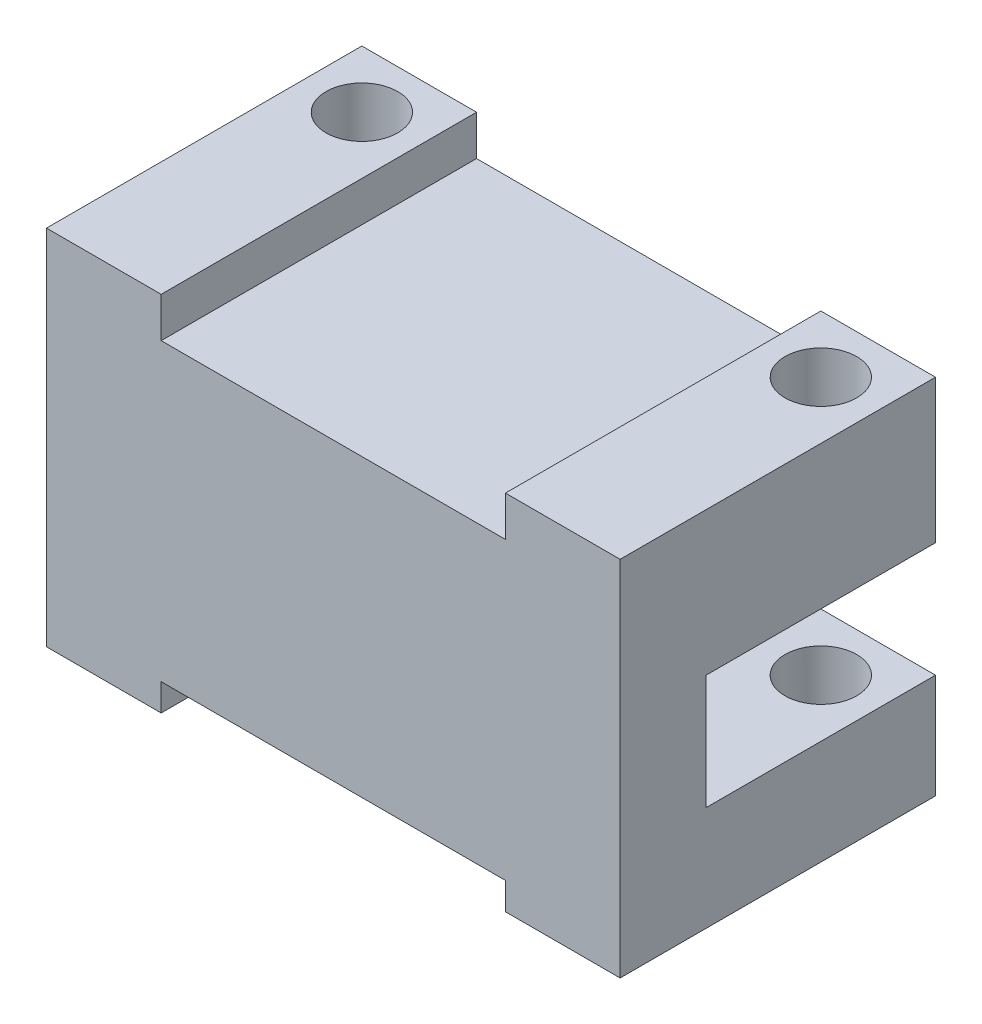
ISO-10303-21;
HEADER;
FILE_DESCRIPTION(('STEP AP214'),'2;1');
FILE_NAME('part.step','',(''),(''),'','','');
FILE_SCHEMA(('AUTOMOTIVE_DESIGN { 1 0 10303 214 1 1 1 1 }'));
ENDSEC;
DATA;
#1=APPLICATION_CONTEXT('core data for automotive mechanical design processes');
#2=APPLICATION_PROTOCOL_DEFINITION('international standard','automotive_design',2000,#1);
#3=PRODUCT_CONTEXT('',#1,'mechanical');
#4=PRODUCT('Part','Part','',(#3));
#5=PRODUCT_RELATED_PRODUCT_CATEGORY('part','',(#4));
#6=PRODUCT_DEFINITION_FORMATION('','',#4);
#7=PRODUCT_DEFINITION_CONTEXT('part definition',#1,'design');
#8=PRODUCT_DEFINITION('design','',#6,#7);
#9=PRODUCT_DEFINITION_SHAPE('','',#8);
#10=(LENGTH_UNIT() NAMED_UNIT(*) SI_UNIT(.MILLI.,.METRE.));
#11=(NAMED_UNIT(*) PLANE_ANGLE_UNIT() SI_UNIT($,.RADIAN.));
#12=(NAMED_UNIT(*) SI_UNIT($,.STERADIAN.) SOLID_ANGLE_UNIT());
#13=UNCERTAINTY_MEASURE_WITH_UNIT(LENGTH_MEASURE(1.E-05),#10,'distance_accuracy_value','');
#14=(GEOMETRIC_REPRESENTATION_CONTEXT(3) GLOBAL_UNCERTAINTY_ASSIGNED_CONTEXT((#13)) GLOBAL_UNIT_ASSIGNED_CONTEXT((#10,
#11,#12)) REPRESENTATION_CONTEXT('',''));
#15=CARTESIAN_POINT('',(0.,0.,0.));
#16=DIRECTION('',(0.,0.,1.));
#17=DIRECTION('',(1.,0.,0.));
#18=AXIS2_PLACEMENT_3D('',#15,#16,#17);
#19=CARTESIAN_POINT('',(20.6185390455604,-73.2027077643161,3.));
#20=DIRECTION('',(0.,-1.,0.));
#21=DIRECTION('',(1.,0.,0.));
#22=AXIS2_PLACEMENT_3D('',#19,#20,#21);
#23=PLANE('',#22);
#24=CARTESIAN_POINT('',(22.6185390455604,-73.2027077643161,-6.));
#25=DIRECTION('',(0.,1.,0.));
#26=DIRECTION('',(0.,0.,1.));
#27=AXIS2_PLACEMENT_3D('',#24,#25,#26);
#28=CIRCLE('',#27,1.25);
#29=CARTESIAN_POINT('',(22.6185390455604,-73.2027077643161,-4.75));
#30=VERTEX_POINT('',#29);
#31=EDGE_CURVE('E423',#30,#30,#28,.T.);
#32=ORIENTED_EDGE('',*,*,#31,.F.);
#33=EDGE_LOOP('',(#32));
#34=FACE_BOUND('',#33,.T.);
#35=DIRECTION('',(-1.,0.,0.));
#36=VECTOR('',#35,1.);
#37=CARTESIAN_POINT('',(20.6185390455604,-73.2027077643161,3.));
#38=LINE('',#37,#36);
#39=CARTESIAN_POINT('',(24.6185390455604,-73.2027077643161,3.));
#40=VERTEX_POINT('',#39);
#41=CARTESIAN_POINT('',(20.6185390455604,-73.2027077643161,3.));
#42=VERTEX_POINT('',#41);
#43=EDGE_CURVE('E338',#40,#42,#38,.T.);
#44=ORIENTED_EDGE('',*,*,#43,.F.);
#45=DIRECTION('',(0.,0.,1.));
#46=VECTOR('',#45,1.);
#47=CARTESIAN_POINT('',(24.6185390455604,-73.2027077643161,-24.7));
#48=LINE('',#47,#46);
#49=CARTESIAN_POINT('',(24.6185390455604,-73.2027077643161,-8.00000000000001));
#50=VERTEX_POINT('',#49);
#51=EDGE_CURVE('E163',#50,#40,#48,.T.);
#52=ORIENTED_EDGE('',*,*,#51,.F.);
#53=DIRECTION('',(1.,0.,0.));
#54=VECTOR('',#53,1.);
#55=CARTESIAN_POINT('',(40.6261390455604,-73.2027077643161,-8.));
#56=LINE('',#55,#54);
#57=CARTESIAN_POINT('',(20.6185390455604,-73.2027077643161,-8.));
#58=VERTEX_POINT('',#57);
#59=EDGE_CURVE('E217',#58,#50,#56,.T.);
#60=ORIENTED_EDGE('',*,*,#59,.F.);
#61=DIRECTION('',(0.,0.,-1.));
#62=VECTOR('',#61,1.);
#63=CARTESIAN_POINT('',(20.6185390455604,-73.2027077643161,3.));
#64=LINE('',#63,#62);
#65=EDGE_CURVE('E260',#42,#58,#64,.T.);
#66=ORIENTED_EDGE('',*,*,#65,.F.);
#67=EDGE_LOOP('',(#44,#52,#60,#66));
#68=FACE_BOUND('',#67,.T.);
#69=ADVANCED_FACE('F33',(#34,#68),#23,.F.);
#70=CARTESIAN_POINT('',(0.,0.,0.));
#71=DIRECTION('',(0.,0.,1.));
#72=DIRECTION('',(1.,0.,0.));
#73=AXIS2_PLACEMENT_3D('',#70,#71,#72);
#74=PLANE('',#73);
#75=DIRECTION('',(1.,0.,0.));
#76=VECTOR('',#75,1.);
#77=CARTESIAN_POINT('',(40.6261390455604,-82.2027077511568,0.));
#78=LINE('',#77,#76);
#79=CARTESIAN_POINT('',(20.6185390455604,-82.2027077511568,0.));
#80=VERTEX_POINT('',#79);
#81=CARTESIAN_POINT('',(40.6261390455604,-82.2027077511568,0.));
#82=VERTEX_POINT('',#81);
#83=EDGE_CURVE('E175',#80,#82,#78,.T.);
#84=ORIENTED_EDGE('',*,*,#83,.F.);
#85=DIRECTION('',(0.,-1.,0.));
#86=VECTOR('',#85,1.);
#87=CARTESIAN_POINT('',(20.6185390455604,-73.2027077643161,0.));
#88=LINE('',#87,#86);
#89=CARTESIAN_POINT('',(20.6185390455604,-78.2027077511569,0.));
#90=VERTEX_POINT('',#89);
#91=EDGE_CURVE('E229',#90,#80,#88,.T.);
#92=ORIENTED_EDGE('',*,*,#91,.F.);
#93=DIRECTION('',(-1.,0.,0.));
#94=VECTOR('',#93,1.);
#95=CARTESIAN_POINT('',(40.6261390455604,-78.2027077511569,0.));
#96=LINE('',#95,#94);
#97=CARTESIAN_POINT('',(40.6261390455604,-78.2027077511569,0.));
#98=VERTEX_POINT('',#97);
#99=EDGE_CURVE('E207',#98,#90,#96,.T.);
#100=ORIENTED_EDGE('',*,*,#99,.F.);
#101=DIRECTION('',(0.,1.,0.));
#102=VECTOR('',#101,1.);
#103=CARTESIAN_POINT('',(40.6261390455604,-85.8498182715212,0.));
#104=LINE('',#103,#102);
#105=EDGE_CURVE('E58',#82,#98,#104,.T.);
#106=ORIENTED_EDGE('',*,*,#105,.F.);
#107=EDGE_LOOP('',(#84,#92,#100,#106));
#108=FACE_BOUND('',#107,.T.);
#109=ADVANCED_FACE('F307',(#108),#74,.F.);
#110=CARTESIAN_POINT('',(36.6261390455604,-85.8498182715212,3.));
#111=DIRECTION('',(0.,1.,0.));
#112=DIRECTION('',(0.,0.,1.));
#113=AXIS2_PLACEMENT_3D('',#110,#111,#112);
#114=PLANE('',#113);
#115=CARTESIAN_POINT('',(38.6261390455604,-85.8498182715212,-6.00000000000001));
#116=DIRECTION('',(0.,1.,0.));
#117=DIRECTION('',(0.,0.,1.));
#118=AXIS2_PLACEMENT_3D('',#115,#116,#117);
#119=CIRCLE('',#118,1.25);
#120=CARTESIAN_POINT('',(38.6261390455604,-85.8498182715212,-4.75000000000001));
#121=VERTEX_POINT('',#120);
#122=EDGE_CURVE('E166',#121,#121,#119,.T.);
#123=ORIENTED_EDGE('',*,*,#122,.T.);
#124=EDGE_LOOP('',(#123));
#125=FACE_BOUND('',#124,.T.);
#126=DIRECTION('',(0.,0.,-1.));
#127=VECTOR('',#126,1.);
#128=CARTESIAN_POINT('',(36.6261390455604,-85.8498182715212,3.));
#129=LINE('',#128,#127);
#130=CARTESIAN_POINT('',(36.6261390455604,-85.8498182715212,3.));
#131=VERTEX_POINT('',#130);
#132=CARTESIAN_POINT('',(36.6261390455604,-85.8498182715212,-8.));
#133=VERTEX_POINT('',#132);
#134=EDGE_CURVE('E250',#131,#133,#129,.T.);
#135=ORIENTED_EDGE('',*,*,#134,.T.);
#136=DIRECTION('',(-1.,0.,0.));
#137=VECTOR('',#136,1.);
#138=CARTESIAN_POINT('',(40.6261390455604,-85.8498182715212,-8.));
#139=LINE('',#138,#137);
#140=CARTESIAN_POINT('',(40.6261390455604,-85.8498182715212,-8.));
#141=VERTEX_POINT('',#140);
#142=EDGE_CURVE('E180',#141,#133,#139,.T.);
#143=ORIENTED_EDGE('',*,*,#142,.F.);
#144=DIRECTION('',(0.,0.,-1.));
#145=VECTOR('',#144,1.);
#146=CARTESIAN_POINT('',(40.6261390455604,-85.8498182715212,3.));
#147=LINE('',#146,#145);
#148=CARTESIAN_POINT('',(40.6261390455604,-85.8498182715212,3.));
#149=VERTEX_POINT('',#148);
#150=EDGE_CURVE('E264',#149,#141,#147,.T.);
#151=ORIENTED_EDGE('',*,*,#150,.F.);
#152=DIRECTION('',(1.,0.,0.));
#153=VECTOR('',#152,1.);
#154=CARTESIAN_POINT('',(36.6261390455604,-85.8498182715212,3.));
#155=LINE('',#154,#153);
#156=EDGE_CURVE('E223',#131,#149,#155,.T.);
#157=ORIENTED_EDGE('',*,*,#156,.F.);
#158=EDGE_LOOP('',(#135,#143,#151,#157));
#159=FACE_BOUND('',#158,.T.);
#160=ADVANCED_FACE('F35',(#125,#159),#114,.F.);
#161=CARTESIAN_POINT('',(40.6261390455604,-85.8498182715212,3.));
#162=DIRECTION('',(-1.,0.,0.));
#163=DIRECTION('',(0.,0.,1.));
#164=AXIS2_PLACEMENT_3D('',#161,#162,#163);
#165=PLANE('',#164);
#166=ORIENTED_EDGE('',*,*,#150,.T.);
#167=DIRECTION('',(0.,-1.,0.));
#168=VECTOR('',#167,1.);
#169=CARTESIAN_POINT('',(40.6261390455604,-82.2027077511568,-8.));
#170=LINE('',#169,#168);
#171=CARTESIAN_POINT('',(40.6261390455604,-82.2027077511568,-8.));
#172=VERTEX_POINT('',#171);
#173=EDGE_CURVE('E199',#172,#141,#170,.T.);
#174=ORIENTED_EDGE('',*,*,#173,.F.);
#175=DIRECTION('',(0.,0.,1.));
#176=VECTOR('',#175,1.);
#177=CARTESIAN_POINT('',(40.6261390455604,-82.2027077511568,-8.));
#178=LINE('',#177,#176);
#179=EDGE_CURVE('E202',#172,#82,#178,.T.);
#180=ORIENTED_EDGE('',*,*,#179,.T.);
#181=ORIENTED_EDGE('',*,*,#105,.T.);
#182=DIRECTION('',(0.,0.,1.));
#183=VECTOR('',#182,1.);
#184=CARTESIAN_POINT('',(40.6261390455604,-78.2027077511569,-8.));
#185=LINE('',#184,#183);
#186=CARTESIAN_POINT('',(40.6261390455604,-78.2027077511569,-8.));
#187=VERTEX_POINT('',#186);
#188=EDGE_CURVE('E234',#187,#98,#185,.T.);
#189=ORIENTED_EDGE('',*,*,#188,.F.);
#190=DIRECTION('',(0.,-1.,0.));
#191=VECTOR('',#190,1.);
#192=CARTESIAN_POINT('',(40.6261390455604,-73.2027077643161,-8.));
#193=LINE('',#192,#191);
#194=CARTESIAN_POINT('',(40.6261390455604,-73.2027077643161,-8.));
#195=VERTEX_POINT('',#194);
#196=EDGE_CURVE('E208',#195,#187,#193,.T.);
#197=ORIENTED_EDGE('',*,*,#196,.F.);
#198=DIRECTION('',(0.,0.,-1.));
#199=VECTOR('',#198,1.);
#200=CARTESIAN_POINT('',(40.6261390455604,-73.2027077643161,3.));
#201=LINE('',#200,#199);
#202=CARTESIAN_POINT('',(40.6261390455604,-73.2027077643161,3.));
#203=VERTEX_POINT('',#202);
#204=EDGE_CURVE('E262',#203,#195,#201,.T.);
#205=ORIENTED_EDGE('',*,*,#204,.F.);
#206=DIRECTION('',(0.,1.,0.));
#207=VECTOR('',#206,1.);
#208=CARTESIAN_POINT('',(40.6261390455604,-85.8498182715212,3.));
#209=LINE('',#208,#207);
#210=EDGE_CURVE('E341',#149,#203,#209,.T.);
#211=ORIENTED_EDGE('',*,*,#210,.F.);
#212=EDGE_LOOP('',(#166,#174,#180,#181,#189,#197,#205,#211));
#213=FACE_BOUND('',#212,.T.);
#214=ADVANCED_FACE('F321',(#213),#165,.F.);
#215=CARTESIAN_POINT('',(38.6261390455604,-73.2027077643161,-6.00000000000001));
#216=DIRECTION('',(0.,1.,0.));
#217=DIRECTION('',(0.,0.,1.));
#218=AXIS2_PLACEMENT_3D('',#215,#216,#217);
#219=CIRCLE('',#218,1.25);
#220=CARTESIAN_POINT('',(38.6261390455604,-73.2027077643161,-4.75000000000001));
#221=VERTEX_POINT('',#220);
#222=EDGE_CURVE('E272',#221,#221,#219,.T.);
#223=ORIENTED_EDGE('',*,*,#222,.F.);
#224=EDGE_LOOP('',(#223));
#225=FACE_BOUND('',#224,.T.);
#226=CARTESIAN_POINT('',(36.6261390455604,-73.2027077643161,-8.00000000000001));
#227=VERTEX_POINT('',#226);
#228=EDGE_CURVE('E216',#227,#195,#56,.T.);
#229=ORIENTED_EDGE('',*,*,#228,.F.);
#230=DIRECTION('',(0.,0.,1.));
#231=VECTOR('',#230,1.);
#232=CARTESIAN_POINT('',(36.6261390455604,-73.2027077643161,-24.7));
#233=LINE('',#232,#231);
#234=CARTESIAN_POINT('',(36.6261390455604,-73.2027077643161,3.));
#235=VERTEX_POINT('',#234);
#236=EDGE_CURVE('E176',#227,#235,#233,.T.);
#237=ORIENTED_EDGE('',*,*,#236,.T.);
#238=EDGE_CURVE('E340',#203,#235,#38,.T.);
#239=ORIENTED_EDGE('',*,*,#238,.F.);
#240=ORIENTED_EDGE('',*,*,#204,.T.);
#241=EDGE_LOOP('',(#229,#237,#239,#240));
#242=FACE_BOUND('',#241,.T.);
#243=ADVANCED_FACE('F310',(#225,#242),#23,.F.);
#244=CARTESIAN_POINT('',(20.6185390455604,-73.2027077643161,3.));
#245=DIRECTION('',(1.,0.,0.));
#246=DIRECTION('',(0.,1.,0.));
#247=AXIS2_PLACEMENT_3D('',#244,#245,#246);
#248=PLANE('',#247);
#249=ORIENTED_EDGE('',*,*,#65,.T.);
#250=DIRECTION('',(0.,1.,0.));
#251=VECTOR('',#250,1.);
#252=CARTESIAN_POINT('',(20.6185390455604,-73.2027077643161,-8.));
#253=LINE('',#252,#251);
#254=CARTESIAN_POINT('',(20.6185390455604,-78.2027077511569,-8.));
#255=VERTEX_POINT('',#254);
#256=EDGE_CURVE('E213',#255,#58,#253,.T.);
#257=ORIENTED_EDGE('',*,*,#256,.F.);
#258=DIRECTION('',(0.,0.,1.));
#259=VECTOR('',#258,1.);
#260=CARTESIAN_POINT('',(20.6185390455604,-78.2027077511569,-8.));
#261=LINE('',#260,#259);
#262=EDGE_CURVE('E220',#255,#90,#261,.T.);
#263=ORIENTED_EDGE('',*,*,#262,.T.);
#264=ORIENTED_EDGE('',*,*,#91,.T.);
#265=DIRECTION('',(0.,0.,1.));
#266=VECTOR('',#265,1.);
#267=CARTESIAN_POINT('',(20.6185390455604,-82.2027077511568,-8.));
#268=LINE('',#267,#266);
#269=CARTESIAN_POINT('',(20.6185390455604,-82.2027077511568,-8.));
#270=VERTEX_POINT('',#269);
#271=EDGE_CURVE('E205',#270,#80,#268,.T.);
#272=ORIENTED_EDGE('',*,*,#271,.F.);
#273=DIRECTION('',(0.,1.,0.));
#274=VECTOR('',#273,1.);
#275=CARTESIAN_POINT('',(20.6185390455604,-85.8498182715212,-8.));
#276=LINE('',#275,#274);
#277=CARTESIAN_POINT('',(20.6185390455604,-85.8498182715212,-8.));
#278=VERTEX_POINT('',#277);
#279=EDGE_CURVE('E195',#278,#270,#276,.T.);
#280=ORIENTED_EDGE('',*,*,#279,.F.);
#281=DIRECTION('',(0.,0.,-1.));
#282=VECTOR('',#281,1.);
#283=CARTESIAN_POINT('',(20.6185390455604,-85.8498182715212,3.));
#284=LINE('',#283,#282);
#285=CARTESIAN_POINT('',(20.6185390455604,-85.8498182715212,3.));
#286=VERTEX_POINT('',#285);
#287=EDGE_CURVE('E258',#286,#278,#284,.T.);
#288=ORIENTED_EDGE('',*,*,#287,.F.);
#289=DIRECTION('',(0.,-1.,0.));
#290=VECTOR('',#289,1.);
#291=CARTESIAN_POINT('',(20.6185390455604,-73.2027077643161,3.));
#292=LINE('',#291,#290);
#293=EDGE_CURVE('E343',#42,#286,#292,.T.);
#294=ORIENTED_EDGE('',*,*,#293,.F.);
#295=EDGE_LOOP('',(#249,#257,#263,#264,#272,#280,#288,#294));
#296=FACE_BOUND('',#295,.T.);
#297=ADVANCED_FACE('F320',(#296),#248,.F.);
#298=CARTESIAN_POINT('',(20.6185390455604,-85.8498182715212,3.));
#299=DIRECTION('',(0.,1.,0.));
#300=DIRECTION('',(0.,0.,1.));
#301=AXIS2_PLACEMENT_3D('',#298,#299,#300);
#302=PLANE('',#301);
#303=CARTESIAN_POINT('',(22.6185390455604,-85.8498182715212,-6.));
#304=DIRECTION('',(0.,1.,0.));
#305=DIRECTION('',(0.,0.,1.));
#306=AXIS2_PLACEMENT_3D('',#303,#304,#305);
#307=CIRCLE('',#306,1.25);
#308=CARTESIAN_POINT('',(22.6185390455604,-85.8498182715212,-4.75));
#309=VERTEX_POINT('',#308);
#310=EDGE_CURVE('E278',#309,#309,#307,.T.);
#311=ORIENTED_EDGE('',*,*,#310,.T.);
#312=EDGE_LOOP('',(#311));
#313=FACE_BOUND('',#312,.T.);
#314=ORIENTED_EDGE('',*,*,#287,.T.);
#315=DIRECTION('',(-1.,0.,0.));
#316=VECTOR('',#315,1.);
#317=CARTESIAN_POINT('',(24.6185390455604,-85.8498182715212,-8.));
#318=LINE('',#317,#316);
#319=CARTESIAN_POINT('',(24.6185390455604,-85.8498182715212,-8.));
#320=VERTEX_POINT('',#319);
#321=EDGE_CURVE('E192',#320,#278,#318,.T.);
#322=ORIENTED_EDGE('',*,*,#321,.F.);
#323=DIRECTION('',(0.,0.,-1.));
#324=VECTOR('',#323,1.);
#325=CARTESIAN_POINT('',(24.6185390455604,-85.8498182715212,3.));
#326=LINE('',#325,#324);
#327=CARTESIAN_POINT('',(24.6185390455604,-85.8498182715212,3.));
#328=VERTEX_POINT('',#327);
#329=EDGE_CURVE('E256',#328,#320,#326,.T.);
#330=ORIENTED_EDGE('',*,*,#329,.F.);
#331=DIRECTION('',(1.,0.,0.));
#332=VECTOR('',#331,1.);
#333=CARTESIAN_POINT('',(20.6185390455604,-85.8498182715212,3.));
#334=LINE('',#333,#332);
#335=EDGE_CURVE('E346',#286,#328,#334,.T.);
#336=ORIENTED_EDGE('',*,*,#335,.F.);
#337=EDGE_LOOP('',(#314,#322,#330,#336));
#338=FACE_BOUND('',#337,.T.);
#339=ADVANCED_FACE('F327',(#313,#338),#302,.F.);
#340=CARTESIAN_POINT('',(24.6185390455604,-84.9027077644928,3.));
#341=DIRECTION('',(-1.,0.,0.));
#342=DIRECTION('',(0.,-1.,0.));
#343=AXIS2_PLACEMENT_3D('',#340,#341,#342);
#344=PLANE('',#343);
#345=ORIENTED_EDGE('',*,*,#329,.T.);
#346=DIRECTION('',(0.,-1.,0.));
#347=VECTOR('',#346,1.);
#348=CARTESIAN_POINT('',(24.6185390455604,-84.9027077644928,-8.));
#349=LINE('',#348,#347);
#350=CARTESIAN_POINT('',(24.6185390455604,-84.9027077644928,-8.));
#351=VERTEX_POINT('',#350);
#352=EDGE_CURVE('E189',#351,#320,#349,.T.);
#353=ORIENTED_EDGE('',*,*,#352,.F.);
#354=DIRECTION('',(0.,0.,-1.));
#355=VECTOR('',#354,1.);
#356=CARTESIAN_POINT('',(24.6185390455604,-84.9027077644928,3.));
#357=LINE('',#356,#355);
#358=CARTESIAN_POINT('',(24.6185390455604,-84.9027077644928,3.));
#359=VERTEX_POINT('',#358);
#360=EDGE_CURVE('E254',#359,#351,#357,.T.);
#361=ORIENTED_EDGE('',*,*,#360,.F.);
#362=DIRECTION('',(0.,1.,0.));
#363=VECTOR('',#362,1.);
#364=CARTESIAN_POINT('',(24.6185390455604,-84.9027077644928,3.));
#365=LINE('',#364,#363);
#366=EDGE_CURVE('E348',#328,#359,#365,.T.);
#367=ORIENTED_EDGE('',*,*,#366,.F.);
#368=EDGE_LOOP('',(#345,#353,#361,#367));
#369=FACE_BOUND('',#368,.T.);
#370=ADVANCED_FACE('F378',(#369),#344,.F.);
#371=CARTESIAN_POINT('',(36.6261390455604,-84.9027077644928,3.));
#372=DIRECTION('',(0.,1.,0.));
#373=DIRECTION('',(0.,0.,1.));
#374=AXIS2_PLACEMENT_3D('',#371,#372,#373);
#375=PLANE('',#374);
#376=ORIENTED_EDGE('',*,*,#360,.T.);
#377=DIRECTION('',(-1.,0.,0.));
#378=VECTOR('',#377,1.);
#379=CARTESIAN_POINT('',(36.6261390455604,-84.9027077644928,-8.));
#380=LINE('',#379,#378);
#381=CARTESIAN_POINT('',(36.6261390455604,-84.9027077644928,-8.));
#382=VERTEX_POINT('',#381);
#383=EDGE_CURVE('E186',#382,#351,#380,.T.);
#384=ORIENTED_EDGE('',*,*,#383,.F.);
#385=DIRECTION('',(0.,0.,-1.));
#386=VECTOR('',#385,1.);
#387=CARTESIAN_POINT('',(36.6261390455604,-84.9027077644928,3.));
#388=LINE('',#387,#386);
#389=CARTESIAN_POINT('',(36.6261390455604,-84.9027077644928,3.));
#390=VERTEX_POINT('',#389);
#391=EDGE_CURVE('E252',#390,#382,#388,.T.);
#392=ORIENTED_EDGE('',*,*,#391,.F.);
#393=DIRECTION('',(1.,0.,0.));
#394=VECTOR('',#393,1.);
#395=CARTESIAN_POINT('',(36.6261390455604,-84.9027077644928,3.));
#396=LINE('',#395,#394);
#397=EDGE_CURVE('E349',#359,#390,#396,.T.);
#398=ORIENTED_EDGE('',*,*,#397,.F.);
#399=EDGE_LOOP('',(#376,#384,#392,#398));
#400=FACE_BOUND('',#399,.T.);
#401=ADVANCED_FACE('F381',(#400),#375,.F.);
#402=CARTESIAN_POINT('',(36.6261390455604,-85.8498182715212,3.));
#403=DIRECTION('',(1.,0.,0.));
#404=DIRECTION('',(0.,0.,-1.));
#405=AXIS2_PLACEMENT_3D('',#402,#403,#404);
#406=PLANE('',#405);
#407=ORIENTED_EDGE('',*,*,#391,.T.);
#408=DIRECTION('',(0.,1.,0.));
#409=VECTOR('',#408,1.);
#410=CARTESIAN_POINT('',(36.6261390455604,-85.8498182715212,-8.));
#411=LINE('',#410,#409);
#412=EDGE_CURVE('E183',#133,#382,#411,.T.);
#413=ORIENTED_EDGE('',*,*,#412,.F.);
#414=ORIENTED_EDGE('',*,*,#134,.F.);
#415=DIRECTION('',(0.,-1.,0.));
#416=VECTOR('',#415,1.);
#417=CARTESIAN_POINT('',(36.6261390455604,-85.8498182715212,3.));
#418=LINE('',#417,#416);
#419=EDGE_CURVE('E246',#390,#131,#418,.T.);
#420=ORIENTED_EDGE('',*,*,#419,.F.);
#421=EDGE_LOOP('',(#407,#413,#414,#420));
#422=FACE_BOUND('',#421,.T.);
#423=ADVANCED_FACE('F358',(#422),#406,.F.);
#424=CARTESIAN_POINT('',(0.,0.,3.));
#425=DIRECTION('',(0.,0.,1.));
#426=DIRECTION('',(1.,0.,0.));
#427=AXIS2_PLACEMENT_3D('',#424,#425,#426);
#428=PLANE('',#427);
#429=DIRECTION('',(0.,-1.,0.));
#430=VECTOR('',#429,1.);
#431=CARTESIAN_POINT('',(24.6185390455604,-73.2027077643161,3.));
#432=LINE('',#431,#430);
#433=CARTESIAN_POINT('',(24.6185390455604,-74.6027077643161,3.));
#434=VERTEX_POINT('',#433);
#435=EDGE_CURVE('E160',#40,#434,#432,.T.);
#436=ORIENTED_EDGE('',*,*,#435,.F.);
#437=ORIENTED_EDGE('',*,*,#43,.T.);
#438=ORIENTED_EDGE('',*,*,#293,.T.);
#439=ORIENTED_EDGE('',*,*,#335,.T.);
#440=ORIENTED_EDGE('',*,*,#366,.T.);
#441=ORIENTED_EDGE('',*,*,#397,.T.);
#442=ORIENTED_EDGE('',*,*,#419,.T.);
#443=ORIENTED_EDGE('',*,*,#156,.T.);
#444=ORIENTED_EDGE('',*,*,#210,.T.);
#445=ORIENTED_EDGE('',*,*,#238,.T.);
#446=DIRECTION('',(0.,1.,0.));
#447=VECTOR('',#446,1.);
#448=CARTESIAN_POINT('',(36.6261390455604,-73.2027077643161,3.));
#449=LINE('',#448,#447);
#450=CARTESIAN_POINT('',(36.6261390455604,-74.6027077643161,3.));
#451=VERTEX_POINT('',#450);
#452=EDGE_CURVE('E157',#451,#235,#449,.T.);
#453=ORIENTED_EDGE('',*,*,#452,.F.);
#454=DIRECTION('',(1.,0.,0.));
#455=VECTOR('',#454,1.);
#456=CARTESIAN_POINT('',(24.6185390455604,-74.6027077643161,3.));
#457=LINE('',#456,#455);
#458=EDGE_CURVE('E151',#434,#451,#457,.T.);
#459=ORIENTED_EDGE('',*,*,#458,.F.);
#460=EDGE_LOOP('',(#436,#437,#438,#439,#440,#441,#442,#443,#444,#445,#453,#459));
#461=FACE_BOUND('',#460,.T.);
#462=ADVANCED_FACE('F168',(#461),#428,.T.);
#463=CARTESIAN_POINT('',(40.6261390455604,-78.2027077511569,-8.));
#464=DIRECTION('',(0.,1.,0.));
#465=DIRECTION('',(0.,0.,1.));
#466=AXIS2_PLACEMENT_3D('',#463,#464,#465);
#467=PLANE('',#466);
#468=CARTESIAN_POINT('',(22.6185390455604,-78.2027077511569,-6.));
#469=DIRECTION('',(0.,1.,0.));
#470=DIRECTION('',(0.,0.,1.));
#471=AXIS2_PLACEMENT_3D('',#468,#469,#470);
#472=CIRCLE('',#471,1.25);
#473=CARTESIAN_POINT('',(22.6185390455604,-78.2027077511569,-4.75));
#474=VERTEX_POINT('',#473);
#475=EDGE_CURVE('E37',#474,#474,#472,.T.);
#476=ORIENTED_EDGE('',*,*,#475,.T.);
#477=EDGE_LOOP('',(#476));
#478=FACE_BOUND('',#477,.T.);
#479=CARTESIAN_POINT('',(38.6261390455604,-78.2027077511569,-6.00000000000001));
#480=DIRECTION('',(0.,1.,0.));
#481=DIRECTION('',(0.,0.,1.));
#482=AXIS2_PLACEMENT_3D('',#479,#480,#481);
#483=CIRCLE('',#482,1.25);
#484=CARTESIAN_POINT('',(38.6261390455604,-78.2027077511569,-4.75000000000001));
#485=VERTEX_POINT('',#484);
#486=EDGE_CURVE('E269',#485,#485,#483,.T.);
#487=ORIENTED_EDGE('',*,*,#486,.T.);
#488=EDGE_LOOP('',(#487));
#489=FACE_BOUND('',#488,.T.);
#490=ORIENTED_EDGE('',*,*,#99,.T.);
#491=ORIENTED_EDGE('',*,*,#262,.F.);
#492=DIRECTION('',(-1.,0.,0.));
#493=VECTOR('',#492,1.);
#494=CARTESIAN_POINT('',(40.6261390455604,-78.2027077511569,-8.));
#495=LINE('',#494,#493);
#496=EDGE_CURVE('E211',#187,#255,#495,.T.);
#497=ORIENTED_EDGE('',*,*,#496,.F.);
#498=ORIENTED_EDGE('',*,*,#188,.T.);
#499=EDGE_LOOP('',(#490,#491,#497,#498));
#500=FACE_BOUND('',#499,.T.);
#501=ADVANCED_FACE('F368',(#478,#489,#500),#467,.F.);
#502=CARTESIAN_POINT('',(0.,0.,-8.));
#503=DIRECTION('',(0.,0.,-1.));
#504=DIRECTION('',(-1.,0.,0.));
#505=AXIS2_PLACEMENT_3D('',#502,#503,#504);
#506=PLANE('',#505);
#507=DIRECTION('',(0.,1.,0.));
#508=VECTOR('',#507,1.);
#509=CARTESIAN_POINT('',(24.6185390455604,0.,-8.));
#510=LINE('',#509,#508);
#511=CARTESIAN_POINT('',(24.6185390455604,-74.6027077643161,-8.00000000000001));
#512=VERTEX_POINT('',#511);
#513=EDGE_CURVE('E11',#512,#50,#510,.T.);
#514=ORIENTED_EDGE('',*,*,#513,.F.);
#515=DIRECTION('',(-1.,0.,0.));
#516=VECTOR('',#515,1.);
#517=CARTESIAN_POINT('',(0.,-74.6027077643161,-8.));
#518=LINE('',#517,#516);
#519=CARTESIAN_POINT('',(36.6261390455604,-74.6027077643161,-8.));
#520=VERTEX_POINT('',#519);
#521=EDGE_CURVE('E154',#520,#512,#518,.T.);
#522=ORIENTED_EDGE('',*,*,#521,.F.);
#523=DIRECTION('',(0.,-1.,0.));
#524=VECTOR('',#523,1.);
#525=CARTESIAN_POINT('',(36.6261390455604,0.,-8.));
#526=LINE('',#525,#524);
#527=EDGE_CURVE('E42',#227,#520,#526,.T.);
#528=ORIENTED_EDGE('',*,*,#527,.F.);
#529=ORIENTED_EDGE('',*,*,#228,.T.);
#530=ORIENTED_EDGE('',*,*,#196,.T.);
#531=ORIENTED_EDGE('',*,*,#496,.T.);
#532=ORIENTED_EDGE('',*,*,#256,.T.);
#533=ORIENTED_EDGE('',*,*,#59,.T.);
#534=EDGE_LOOP('',(#514,#522,#528,#529,#530,#531,#532,#533));
#535=FACE_BOUND('',#534,.T.);
#536=ADVANCED_FACE('F335',(#535),#506,.T.);
#537=CARTESIAN_POINT('',(40.6261390455604,-82.2027077511568,-8.));
#538=DIRECTION('',(0.,-1.,0.));
#539=DIRECTION('',(0.,0.,-1.));
#540=AXIS2_PLACEMENT_3D('',#537,#538,#539);
#541=PLANE('',#540);
#542=CARTESIAN_POINT('',(22.6185390455604,-82.2027077511568,-6.));
#543=DIRECTION('',(0.,-1.,0.));
#544=DIRECTION('',(0.,0.,-1.));
#545=AXIS2_PLACEMENT_3D('',#542,#543,#544);
#546=CIRCLE('',#545,1.25);
#547=CARTESIAN_POINT('',(22.6185390455604,-82.2027077511568,-7.25));
#548=VERTEX_POINT('',#547);
#549=EDGE_CURVE('E283',#548,#548,#546,.T.);
#550=ORIENTED_EDGE('',*,*,#549,.T.);
#551=EDGE_LOOP('',(#550));
#552=FACE_BOUND('',#551,.T.);
#553=CARTESIAN_POINT('',(38.6261390455604,-82.2027077511568,-6.00000000000001));
#554=DIRECTION('',(0.,-1.,0.));
#555=DIRECTION('',(0.,0.,-1.));
#556=AXIS2_PLACEMENT_3D('',#553,#554,#555);
#557=CIRCLE('',#556,1.25);
#558=CARTESIAN_POINT('',(38.6261390455604,-82.2027077511568,-7.25));
#559=VERTEX_POINT('',#558);
#560=EDGE_CURVE('E271',#559,#559,#557,.T.);
#561=ORIENTED_EDGE('',*,*,#560,.T.);
#562=EDGE_LOOP('',(#561));
#563=FACE_BOUND('',#562,.T.);
#564=ORIENTED_EDGE('',*,*,#83,.T.);
#565=ORIENTED_EDGE('',*,*,#179,.F.);
#566=DIRECTION('',(1.,0.,0.));
#567=VECTOR('',#566,1.);
#568=CARTESIAN_POINT('',(40.6261390455604,-82.2027077511568,-8.));
#569=LINE('',#568,#567);
#570=EDGE_CURVE('E197',#270,#172,#569,.T.);
#571=ORIENTED_EDGE('',*,*,#570,.F.);
#572=ORIENTED_EDGE('',*,*,#271,.T.);
#573=EDGE_LOOP('',(#564,#565,#571,#572));
#574=FACE_BOUND('',#573,.T.);
#575=ADVANCED_FACE('F386',(#552,#563,#574),#541,.F.);
#576=CARTESIAN_POINT('',(0.,0.,-8.));
#577=DIRECTION('',(0.,0.,-1.));
#578=DIRECTION('',(-1.,0.,0.));
#579=AXIS2_PLACEMENT_3D('',#576,#577,#578);
#580=PLANE('',#579);
#581=ORIENTED_EDGE('',*,*,#142,.T.);
#582=ORIENTED_EDGE('',*,*,#412,.T.);
#583=ORIENTED_EDGE('',*,*,#383,.T.);
#584=ORIENTED_EDGE('',*,*,#352,.T.);
#585=ORIENTED_EDGE('',*,*,#321,.T.);
#586=ORIENTED_EDGE('',*,*,#279,.T.);
#587=ORIENTED_EDGE('',*,*,#570,.T.);
#588=ORIENTED_EDGE('',*,*,#173,.T.);
#589=EDGE_LOOP('',(#581,#582,#583,#584,#585,#586,#587,#588));
#590=FACE_BOUND('',#589,.T.);
#591=ADVANCED_FACE('F383',(#590),#580,.T.);
#592=CARTESIAN_POINT('',(24.6185390455604,-73.2027077643161,-24.7));
#593=DIRECTION('',(-1.,0.,0.));
#594=DIRECTION('',(0.,0.,1.));
#595=AXIS2_PLACEMENT_3D('',#592,#593,#594);
#596=PLANE('',#595);
#597=ORIENTED_EDGE('',*,*,#513,.T.);
#598=ORIENTED_EDGE('',*,*,#51,.T.);
#599=ORIENTED_EDGE('',*,*,#435,.T.);
#600=DIRECTION('',(0.,0.,1.));
#601=VECTOR('',#600,1.);
#602=CARTESIAN_POINT('',(24.6185390455604,-74.6027077643161,-24.7));
#603=LINE('',#602,#601);
#604=EDGE_CURVE('E147',#512,#434,#603,.T.);
#605=ORIENTED_EDGE('',*,*,#604,.F.);
#606=EDGE_LOOP('',(#597,#598,#599,#605));
#607=FACE_BOUND('',#606,.T.);
#608=ADVANCED_FACE('F161',(#607),#596,.F.);
#609=CARTESIAN_POINT('',(36.6261390455604,-73.2027077643161,-24.7));
#610=DIRECTION('',(1.,0.,0.));
#611=DIRECTION('',(0.,0.,-1.));
#612=AXIS2_PLACEMENT_3D('',#609,#610,#611);
#613=PLANE('',#612);
#614=ORIENTED_EDGE('',*,*,#527,.T.);
#615=DIRECTION('',(0.,0.,1.));
#616=VECTOR('',#615,1.);
#617=CARTESIAN_POINT('',(36.6261390455604,-74.6027077643161,-24.7));
#618=LINE('',#617,#616);
#619=EDGE_CURVE('E50',#520,#451,#618,.T.);
#620=ORIENTED_EDGE('',*,*,#619,.T.);
#621=ORIENTED_EDGE('',*,*,#452,.T.);
#622=ORIENTED_EDGE('',*,*,#236,.F.);
#623=EDGE_LOOP('',(#614,#620,#621,#622));
#624=FACE_BOUND('',#623,.T.);
#625=ADVANCED_FACE('F494',(#624),#613,.F.);
#626=CARTESIAN_POINT('',(24.6185390455604,-74.6027077643161,-24.7));
#627=DIRECTION('',(0.,-1.,0.));
#628=DIRECTION('',(0.,0.,-1.));
#629=AXIS2_PLACEMENT_3D('',#626,#627,#628);
#630=PLANE('',#629);
#631=ORIENTED_EDGE('',*,*,#521,.T.);
#632=ORIENTED_EDGE('',*,*,#604,.T.);
#633=ORIENTED_EDGE('',*,*,#458,.T.);
#634=ORIENTED_EDGE('',*,*,#619,.F.);
#635=EDGE_LOOP('',(#631,#632,#633,#634));
#636=FACE_BOUND('',#635,.T.);
#637=ADVANCED_FACE('F149',(#636),#630,.F.);
#638=CARTESIAN_POINT('',(38.6261390455604,-73.2027077643161,-6.00000000000001));
#639=DIRECTION('',(0.,1.,0.));
#640=DIRECTION('',(0.,0.,1.));
#641=AXIS2_PLACEMENT_3D('',#638,#639,#640);
#642=CYLINDRICAL_SURFACE('',#641,1.25);
#643=ORIENTED_EDGE('',*,*,#222,.T.);
#644=EDGE_LOOP('',(#643));
#645=FACE_BOUND('',#644,.T.);
#646=ORIENTED_EDGE('',*,*,#486,.F.);
#647=EDGE_LOOP('',(#646));
#648=FACE_BOUND('',#647,.T.);
#649=ADVANCED_FACE('F294',(#645,#648),#642,.F.);
#650=ORIENTED_EDGE('',*,*,#560,.F.);
#651=EDGE_LOOP('',(#650));
#652=FACE_BOUND('',#651,.T.);
#653=ORIENTED_EDGE('',*,*,#122,.F.);
#654=EDGE_LOOP('',(#653));
#655=FACE_BOUND('',#654,.T.);
#656=ADVANCED_FACE('F291',(#652,#655),#642,.F.);
#657=CARTESIAN_POINT('',(22.6185390455604,-73.2027077643161,-6.));
#658=DIRECTION('',(0.,1.,0.));
#659=DIRECTION('',(0.,0.,1.));
#660=AXIS2_PLACEMENT_3D('',#657,#658,#659);
#661=CYLINDRICAL_SURFACE('',#660,1.25);
#662=ORIENTED_EDGE('',*,*,#31,.T.);
#663=EDGE_LOOP('',(#662));
#664=FACE_BOUND('',#663,.T.);
#665=ORIENTED_EDGE('',*,*,#475,.F.);
#666=EDGE_LOOP('',(#665));
#667=FACE_BOUND('',#666,.T.);
#668=ADVANCED_FACE('F293',(#664,#667),#661,.F.);
#669=ORIENTED_EDGE('',*,*,#549,.F.);
#670=EDGE_LOOP('',(#669));
#671=FACE_BOUND('',#670,.T.);
#672=ORIENTED_EDGE('',*,*,#310,.F.);
#673=EDGE_LOOP('',(#672));
#674=FACE_BOUND('',#673,.T.);
#675=ADVANCED_FACE('F301',(#671,#674),#661,.F.);
#676=CLOSED_SHELL('',(#69,#109,#160,#214,#243,#297,#339,#370,#401,#423,#462,#501,#536,#575,#591,
#608,#625,#637,#649,#656,#668,#675));
#677=MANIFOLD_SOLID_BREP('B2',#676);
#678=ADVANCED_BREP_SHAPE_REPRESENTATION('',(#18,#677),#14);
#679=SHAPE_DEFINITION_REPRESENTATION(#9,#678);
ENDSEC;
END-ISO-10303-21;
